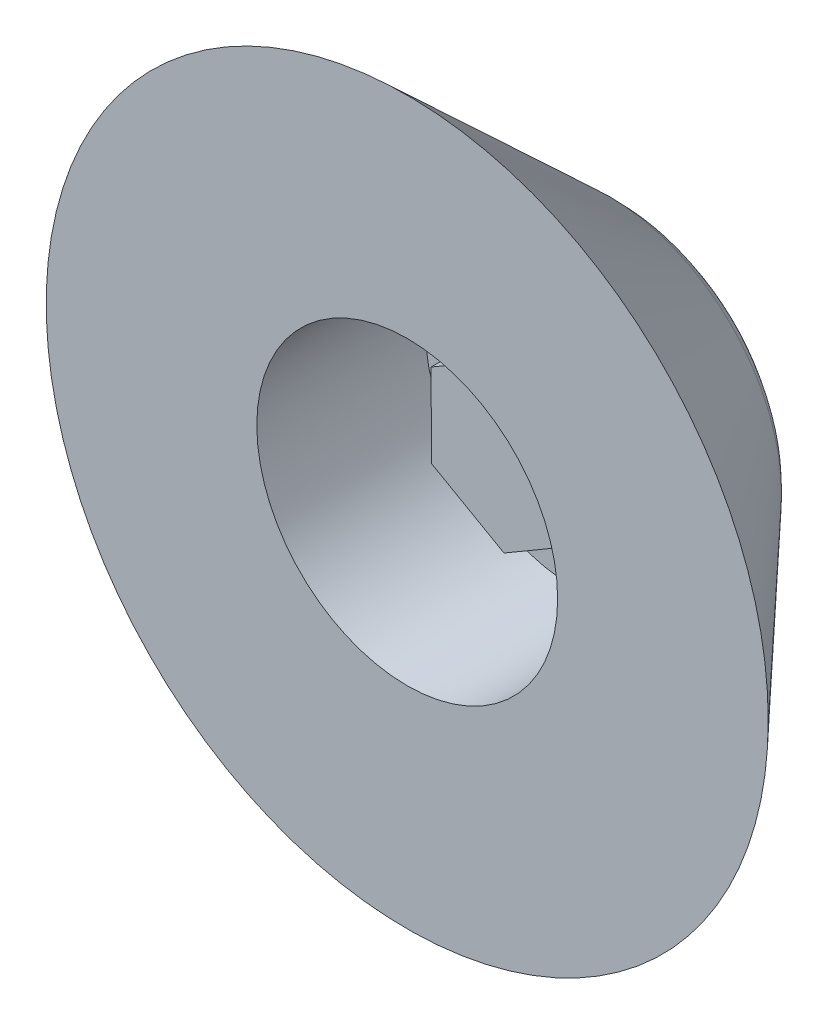
ISO-10303-21;
HEADER;
FILE_DESCRIPTION(('STEP AP214'),'2;1');
FILE_NAME('part.step','',(''),(''),'','','');
FILE_SCHEMA(('AUTOMOTIVE_DESIGN { 1 0 10303 214 1 1 1 1 }'));
ENDSEC;
DATA;
#1=APPLICATION_CONTEXT('core data for automotive mechanical design processes');
#2=APPLICATION_PROTOCOL_DEFINITION('international standard','automotive_design',2000,#1);
#3=PRODUCT_CONTEXT('',#1,'mechanical');
#4=PRODUCT('Part','Part','',(#3));
#5=PRODUCT_RELATED_PRODUCT_CATEGORY('part','',(#4));
#6=PRODUCT_DEFINITION_FORMATION('','',#4);
#7=PRODUCT_DEFINITION_CONTEXT('part definition',#1,'design');
#8=PRODUCT_DEFINITION('design','',#6,#7);
#9=PRODUCT_DEFINITION_SHAPE('','',#8);
#10=(LENGTH_UNIT() NAMED_UNIT(*) SI_UNIT(.MILLI.,.METRE.));
#11=(NAMED_UNIT(*) PLANE_ANGLE_UNIT() SI_UNIT($,.RADIAN.));
#12=(NAMED_UNIT(*) SI_UNIT($,.STERADIAN.) SOLID_ANGLE_UNIT());
#13=UNCERTAINTY_MEASURE_WITH_UNIT(LENGTH_MEASURE(1.E-05),#10,'distance_accuracy_value','');
#14=(GEOMETRIC_REPRESENTATION_CONTEXT(3) GLOBAL_UNCERTAINTY_ASSIGNED_CONTEXT((#13)) GLOBAL_UNIT_ASSIGNED_CONTEXT((#10,
#11,#12)) REPRESENTATION_CONTEXT('',''));
#15=CARTESIAN_POINT('',(0.,0.,0.));
#16=DIRECTION('',(0.,0.,1.));
#17=DIRECTION('',(1.,0.,0.));
#18=AXIS2_PLACEMENT_3D('',#15,#16,#17);
#19=CARTESIAN_POINT('',(3.0104357273615,-1.71384851472511,-7.));
#20=DIRECTION('',(0.999981657172069,0.0060568407112784,0.));
#21=DIRECTION('',(-0.00605684071127841,0.99998165717207,0.));
#22=AXIS2_PLACEMENT_3D('',#19,#20,#21);
#23=PLANE('',#22);
#24=DIRECTION('',(0.,0.,1.));
#25=VECTOR('',#24,1.);
#26=CARTESIAN_POINT('',(2.98945421567092,1.75018955899278,-7.));
#27=LINE('',#26,#25);
#28=CARTESIAN_POINT('',(2.98945421567092,1.75018955899278,-7.));
#29=VERTEX_POINT('',#28);
#30=CARTESIAN_POINT('',(2.98945421567092,1.75018955899278,-4.));
#31=VERTEX_POINT('',#30);
#32=EDGE_CURVE('E114',#29,#31,#27,.T.);
#33=ORIENTED_EDGE('',*,*,#32,.T.);
#34=DIRECTION('',(-0.00605684071128592,0.999981657172069,0.));
#35=VECTOR('',#34,1.);
#36=CARTESIAN_POINT('',(3.01043572736151,-1.71384851472509,-4.));
#37=LINE('',#36,#35);
#38=CARTESIAN_POINT('',(3.01043572736151,-1.71384851472509,-4.));
#39=VERTEX_POINT('',#38);
#40=EDGE_CURVE('E55',#39,#31,#37,.T.);
#41=ORIENTED_EDGE('',*,*,#40,.F.);
#42=DIRECTION('',(0.,0.,1.));
#43=VECTOR('',#42,1.);
#44=CARTESIAN_POINT('',(3.0104357273615,-1.71384851472511,-7.));
#45=LINE('',#44,#43);
#46=CARTESIAN_POINT('',(3.0104357273615,-1.71384851472511,-7.));
#47=VERTEX_POINT('',#46);
#48=EDGE_CURVE('E133',#47,#39,#45,.T.);
#49=ORIENTED_EDGE('',*,*,#48,.F.);
#50=DIRECTION('',(-0.0060568407112784,0.999981657172069,0.));
#51=VECTOR('',#50,1.);
#52=CARTESIAN_POINT('',(3.0104357273615,-1.71384851472511,-7.));
#53=LINE('',#52,#51);
#54=EDGE_CURVE('E229',#47,#29,#53,.T.);
#55=ORIENTED_EDGE('',*,*,#54,.T.);
#56=EDGE_LOOP('',(#33,#41,#49,#55));
#57=FACE_BOUND('',#56,.T.);
#58=ADVANCED_FACE('F39',(#57),#23,.T.);
#59=CARTESIAN_POINT('',(0.0209815116905734,-3.46403807371789,-7.));
#60=DIRECTION('',(0.505236206508678,-0.862981098073834,0.));
#61=DIRECTION('',(0.862981098073834,0.505236206508678,0.));
#62=AXIS2_PLACEMENT_3D('',#59,#60,#61);
#63=PLANE('',#62);
#64=ORIENTED_EDGE('',*,*,#48,.T.);
#65=DIRECTION('',(0.86298109807383,0.505236206508684,0.));
#66=VECTOR('',#65,1.);
#67=CARTESIAN_POINT('',(0.0209815116905981,-3.46403807371789,-4.));
#68=LINE('',#67,#66);
#69=CARTESIAN_POINT('',(0.0209815116905981,-3.46403807371789,-4.));
#70=VERTEX_POINT('',#69);
#71=EDGE_CURVE('E235',#70,#39,#68,.T.);
#72=ORIENTED_EDGE('',*,*,#71,.F.);
#73=DIRECTION('',(0.,0.,1.));
#74=VECTOR('',#73,1.);
#75=CARTESIAN_POINT('',(0.0209815116905734,-3.46403807371789,-7.));
#76=LINE('',#75,#74);
#77=CARTESIAN_POINT('',(0.0209815116905734,-3.46403807371789,-7.));
#78=VERTEX_POINT('',#77);
#79=EDGE_CURVE('E202',#78,#70,#76,.T.);
#80=ORIENTED_EDGE('',*,*,#79,.F.);
#81=DIRECTION('',(0.862981098073834,0.505236206508678,0.));
#82=VECTOR('',#81,1.);
#83=CARTESIAN_POINT('',(0.0209815116905734,-3.46403807371789,-7.));
#84=LINE('',#83,#82);
#85=EDGE_CURVE('E120',#78,#47,#84,.T.);
#86=ORIENTED_EDGE('',*,*,#85,.T.);
#87=EDGE_LOOP('',(#64,#72,#80,#86));
#88=FACE_BOUND('',#87,.T.);
#89=ADVANCED_FACE('F152',(#88),#63,.T.);
#90=CARTESIAN_POINT('',(-2.98945421567092,-1.75018955899278,-7.));
#91=DIRECTION('',(-0.494745450663392,-0.869037938785113,0.));
#92=DIRECTION('',(0.869037938785113,-0.494745450663392,0.));
#93=AXIS2_PLACEMENT_3D('',#90,#91,#92);
#94=PLANE('',#93);
#95=ORIENTED_EDGE('',*,*,#79,.T.);
#96=DIRECTION('',(0.869037938785116,-0.494745450663385,0.));
#97=VECTOR('',#96,1.);
#98=CARTESIAN_POINT('',(-2.98945421567091,-1.7501895589928,-4.));
#99=LINE('',#98,#97);
#100=CARTESIAN_POINT('',(-2.98945421567091,-1.7501895589928,-4.));
#101=VERTEX_POINT('',#100);
#102=EDGE_CURVE('E203',#101,#70,#99,.T.);
#103=ORIENTED_EDGE('',*,*,#102,.F.);
#104=DIRECTION('',(0.,0.,1.));
#105=VECTOR('',#104,1.);
#106=CARTESIAN_POINT('',(-2.98945421567092,-1.75018955899278,-7.));
#107=LINE('',#106,#105);
#108=CARTESIAN_POINT('',(-2.98945421567092,-1.75018955899278,-7.));
#109=VERTEX_POINT('',#108);
#110=EDGE_CURVE('E118',#109,#101,#107,.T.);
#111=ORIENTED_EDGE('',*,*,#110,.F.);
#112=DIRECTION('',(0.869037938785113,-0.494745450663392,0.));
#113=VECTOR('',#112,1.);
#114=CARTESIAN_POINT('',(-2.98945421567092,-1.75018955899278,-7.));
#115=LINE('',#114,#113);
#116=EDGE_CURVE('E206',#109,#78,#115,.T.);
#117=ORIENTED_EDGE('',*,*,#116,.T.);
#118=EDGE_LOOP('',(#95,#103,#111,#117));
#119=FACE_BOUND('',#118,.T.);
#120=ADVANCED_FACE('F158',(#119),#94,.T.);
#121=CARTESIAN_POINT('',(-3.01043572736149,1.71384851472511,-7.));
#122=DIRECTION('',(-0.99998165717207,-0.00605684071127803,0.));
#123=DIRECTION('',(0.00605684071127803,-0.99998165717207,0.));
#124=AXIS2_PLACEMENT_3D('',#121,#122,#123);
#125=PLANE('',#124);
#126=ORIENTED_EDGE('',*,*,#110,.T.);
#127=DIRECTION('',(0.00605684071128605,-0.999981657172069,0.));
#128=VECTOR('',#127,1.);
#129=CARTESIAN_POINT('',(-3.01043572736151,1.71384851472509,-4.));
#130=LINE('',#129,#128);
#131=CARTESIAN_POINT('',(-3.01043572736151,1.71384851472509,-4.));
#132=VERTEX_POINT('',#131);
#133=EDGE_CURVE('E109',#132,#101,#130,.T.);
#134=ORIENTED_EDGE('',*,*,#133,.F.);
#135=DIRECTION('',(0.,0.,1.));
#136=VECTOR('',#135,1.);
#137=CARTESIAN_POINT('',(-3.01043572736149,1.71384851472511,-7.));
#138=LINE('',#137,#136);
#139=CARTESIAN_POINT('',(-3.01043572736149,1.71384851472511,-7.));
#140=VERTEX_POINT('',#139);
#141=EDGE_CURVE('E107',#140,#132,#138,.T.);
#142=ORIENTED_EDGE('',*,*,#141,.F.);
#143=DIRECTION('',(0.00605684071127803,-0.999981657172069,0.));
#144=VECTOR('',#143,1.);
#145=CARTESIAN_POINT('',(-3.01043572736149,1.71384851472511,-7.));
#146=LINE('',#145,#144);
#147=EDGE_CURVE('E221',#140,#109,#146,.T.);
#148=ORIENTED_EDGE('',*,*,#147,.T.);
#149=EDGE_LOOP('',(#126,#134,#142,#148));
#150=FACE_BOUND('',#149,.T.);
#151=ADVANCED_FACE('F188',(#150),#125,.T.);
#152=CARTESIAN_POINT('',(-0.0209815116905708,3.4640380737179,-7.));
#153=DIRECTION('',(-0.505236206508678,0.862981098073834,0.));
#154=DIRECTION('',(-0.862981098073834,-0.505236206508678,0.));
#155=AXIS2_PLACEMENT_3D('',#152,#153,#154);
#156=PLANE('',#155);
#157=ORIENTED_EDGE('',*,*,#141,.T.);
#158=DIRECTION('',(-0.86298109807383,-0.505236206508684,0.));
#159=VECTOR('',#158,1.);
#160=CARTESIAN_POINT('',(-0.0209815116905981,3.46403807371789,-4.));
#161=LINE('',#160,#159);
#162=CARTESIAN_POINT('',(-0.0209815116905981,3.46403807371789,-4.));
#163=VERTEX_POINT('',#162);
#164=EDGE_CURVE('E95',#163,#132,#161,.T.);
#165=ORIENTED_EDGE('',*,*,#164,.F.);
#166=DIRECTION('',(0.,0.,1.));
#167=VECTOR('',#166,1.);
#168=CARTESIAN_POINT('',(-0.0209815116905708,3.4640380737179,-7.));
#169=LINE('',#168,#167);
#170=CARTESIAN_POINT('',(-0.0209815116905708,3.4640380737179,-7.));
#171=VERTEX_POINT('',#170);
#172=EDGE_CURVE('E105',#171,#163,#169,.T.);
#173=ORIENTED_EDGE('',*,*,#172,.F.);
#174=DIRECTION('',(-0.862981098073834,-0.505236206508678,0.));
#175=VECTOR('',#174,1.);
#176=CARTESIAN_POINT('',(-0.0209815116905708,3.4640380737179,-7.));
#177=LINE('',#176,#175);
#178=EDGE_CURVE('E63',#171,#140,#177,.T.);
#179=ORIENTED_EDGE('',*,*,#178,.T.);
#180=EDGE_LOOP('',(#157,#165,#173,#179));
#181=FACE_BOUND('',#180,.T.);
#182=ADVANCED_FACE('F104',(#181),#156,.T.);
#183=CARTESIAN_POINT('',(2.98945421567092,1.75018955899278,-7.));
#184=DIRECTION('',(0.494745450663392,0.869037938785113,0.));
#185=DIRECTION('',(-0.869037938785113,0.494745450663392,0.));
#186=AXIS2_PLACEMENT_3D('',#183,#184,#185);
#187=PLANE('',#186);
#188=ORIENTED_EDGE('',*,*,#172,.T.);
#189=DIRECTION('',(-0.869037938785116,0.494745450663385,0.));
#190=VECTOR('',#189,1.);
#191=CARTESIAN_POINT('',(2.98945421567091,1.75018955899281,-4.));
#192=LINE('',#191,#190);
#193=EDGE_CURVE('E92',#31,#163,#192,.T.);
#194=ORIENTED_EDGE('',*,*,#193,.F.);
#195=ORIENTED_EDGE('',*,*,#32,.F.);
#196=DIRECTION('',(-0.869037938785113,0.494745450663392,0.));
#197=VECTOR('',#196,1.);
#198=CARTESIAN_POINT('',(2.98945421567092,1.75018955899278,-7.));
#199=LINE('',#198,#197);
#200=EDGE_CURVE('E112',#29,#171,#199,.T.);
#201=ORIENTED_EDGE('',*,*,#200,.T.);
#202=EDGE_LOOP('',(#188,#194,#195,#201));
#203=FACE_BOUND('',#202,.T.);
#204=ADVANCED_FACE('F111',(#203),#187,.T.);
#205=CARTESIAN_POINT('',(15.,0.,0.));
#206=DIRECTION('',(0.,0.,1.));
#207=DIRECTION('',(1.,0.,0.));
#208=AXIS2_PLACEMENT_3D('',#205,#206,#207);
#209=PLANE('',#208);
#210=CARTESIAN_POINT('',(0.,0.,0.));
#211=DIRECTION('',(0.,0.,1.));
#212=DIRECTION('',(1.,0.,0.));
#213=AXIS2_PLACEMENT_3D('',#210,#211,#212);
#214=CIRCLE('',#213,6.25);
#215=CARTESIAN_POINT('',(6.25,0.,0.));
#216=VERTEX_POINT('',#215);
#217=EDGE_CURVE('E129',#216,#216,#214,.T.);
#218=ORIENTED_EDGE('',*,*,#217,.F.);
#219=EDGE_LOOP('',(#218));
#220=FACE_BOUND('',#219,.T.);
#221=CARTESIAN_POINT('',(0.,0.,0.));
#222=DIRECTION('',(0.,0.,1.));
#223=DIRECTION('',(1.,0.,0.));
#224=AXIS2_PLACEMENT_3D('',#221,#222,#223);
#225=CIRCLE('',#224,15.);
#226=CARTESIAN_POINT('',(15.,0.,0.));
#227=VERTEX_POINT('',#226);
#228=EDGE_CURVE('E128',#227,#227,#225,.T.);
#229=ORIENTED_EDGE('',*,*,#228,.T.);
#230=EDGE_LOOP('',(#229));
#231=FACE_BOUND('',#230,.T.);
#232=ADVANCED_FACE('F174',(#220,#231),#209,.T.);
#233=CARTESIAN_POINT('',(0.,0.,-10.));
#234=DIRECTION('',(0.,0.,-1.));
#235=DIRECTION('',(-1.,0.,0.));
#236=AXIS2_PLACEMENT_3D('',#233,#234,#235);
#237=PLANE('',#236);
#238=CARTESIAN_POINT('',(0.,0.,-10.));
#239=DIRECTION('',(0.,0.,-1.));
#240=DIRECTION('',(-1.,0.,0.));
#241=AXIS2_PLACEMENT_3D('',#238,#239,#240);
#242=CIRCLE('',#241,3.48774229514954);
#243=CARTESIAN_POINT('',(-3.48774229514954,0.,-10.));
#244=VERTEX_POINT('',#243);
#245=EDGE_CURVE('E11',#244,#244,#242,.T.);
#246=ORIENTED_EDGE('',*,*,#245,.T.);
#247=EDGE_LOOP('',(#246));
#248=FACE_BOUND('',#247,.T.);
#249=ADVANCED_FACE('F172',(#248),#237,.T.);
#250=CARTESIAN_POINT('',(0.,0.,0.));
#251=DIRECTION('',(0.,0.,1.));
#252=DIRECTION('',(1.,0.,0.));
#253=AXIS2_PLACEMENT_3D('',#250,#251,#252);
#254=CONICAL_SURFACE('',#253,15.,0.75132045181044);
#255=CARTESIAN_POINT('',(0.,0.,-8.41302162691979));
#256=DIRECTION('',(0.,0.,-1.));
#257=DIRECTION('',(-1.,0.,0.));
#258=AXIS2_PLACEMENT_3D('',#255,#256,#257);
#259=CIRCLE('',#258,7.14168309573427);
#260=CARTESIAN_POINT('',(-7.14168309573427,0.,-8.41302162691979));
#261=VERTEX_POINT('',#260);
#262=EDGE_CURVE('E48',#261,#261,#259,.F.);
#263=ORIENTED_EDGE('',*,*,#262,.T.);
#264=EDGE_LOOP('',(#263));
#265=FACE_BOUND('',#264,.T.);
#266=ORIENTED_EDGE('',*,*,#228,.F.);
#267=EDGE_LOOP('',(#266));
#268=FACE_BOUND('',#267,.T.);
#269=ADVANCED_FACE('F140',(#265,#268),#254,.T.);
#270=CARTESIAN_POINT('',(0.,0.,-7.));
#271=DIRECTION('',(0.,0.,1.));
#272=DIRECTION('',(1.,0.,0.));
#273=AXIS2_PLACEMENT_3D('',#270,#271,#272);
#274=CYLINDRICAL_SURFACE('',#273,6.25);
#275=CARTESIAN_POINT('',(0.,0.,-7.));
#276=DIRECTION('',(0.,0.,1.));
#277=DIRECTION('',(1.,0.,0.));
#278=AXIS2_PLACEMENT_3D('',#275,#276,#277);
#279=CIRCLE('',#278,6.25);
#280=CARTESIAN_POINT('',(6.25,0.,-7.));
#281=VERTEX_POINT('',#280);
#282=EDGE_CURVE('E124',#281,#281,#279,.T.);
#283=ORIENTED_EDGE('',*,*,#282,.F.);
#284=EDGE_LOOP('',(#283));
#285=FACE_BOUND('',#284,.T.);
#286=ORIENTED_EDGE('',*,*,#217,.T.);
#287=EDGE_LOOP('',(#286));
#288=FACE_BOUND('',#287,.T.);
#289=ADVANCED_FACE('F166',(#285,#288),#274,.F.);
#290=CARTESIAN_POINT('',(0.,0.,-7.));
#291=DIRECTION('',(0.,0.,1.));
#292=DIRECTION('',(1.,0.,0.));
#293=AXIS2_PLACEMENT_3D('',#290,#291,#292);
#294=PLANE('',#293);
#295=ORIENTED_EDGE('',*,*,#85,.F.);
#296=ORIENTED_EDGE('',*,*,#116,.F.);
#297=ORIENTED_EDGE('',*,*,#147,.F.);
#298=ORIENTED_EDGE('',*,*,#178,.F.);
#299=ORIENTED_EDGE('',*,*,#200,.F.);
#300=ORIENTED_EDGE('',*,*,#54,.F.);
#301=EDGE_LOOP('',(#295,#296,#297,#298,#299,#300));
#302=FACE_BOUND('',#301,.T.);
#303=ORIENTED_EDGE('',*,*,#282,.T.);
#304=EDGE_LOOP('',(#303));
#305=FACE_BOUND('',#304,.T.);
#306=ADVANCED_FACE('F148',(#302,#305),#294,.T.);
#307=CARTESIAN_POINT('',(0.,0.,-4.));
#308=DIRECTION('',(0.,0.,1.));
#309=DIRECTION('',(1.,0.,0.));
#310=AXIS2_PLACEMENT_3D('',#307,#308,#309);
#311=PLANE('',#310);
#312=ORIENTED_EDGE('',*,*,#193,.T.);
#313=ORIENTED_EDGE('',*,*,#164,.T.);
#314=ORIENTED_EDGE('',*,*,#133,.T.);
#315=ORIENTED_EDGE('',*,*,#102,.T.);
#316=ORIENTED_EDGE('',*,*,#71,.T.);
#317=ORIENTED_EDGE('',*,*,#40,.T.);
#318=EDGE_LOOP('',(#312,#313,#314,#315,#316,#317));
#319=FACE_BOUND('',#318,.T.);
#320=ADVANCED_FACE('F94',(#319),#311,.T.);
#321=CARTESIAN_POINT('',(0.,0.,-5.));
#322=DIRECTION('',(0.,0.,-1.));
#323=DIRECTION('',(-1.,0.,0.));
#324=AXIS2_PLACEMENT_3D('',#321,#322,#323);
#325=DEGENERATE_TOROIDAL_SURFACE('',#324,3.48774229514954,5.,.T.);
#326=ORIENTED_EDGE('',*,*,#245,.F.);
#327=EDGE_LOOP('',(#326));
#328=FACE_BOUND('',#327,.T.);
#329=ORIENTED_EDGE('',*,*,#262,.F.);
#330=EDGE_LOOP('',(#329));
#331=FACE_BOUND('',#330,.T.);
#332=ADVANCED_FACE('F41',(#328,#331),#325,.T.);
#333=CLOSED_SHELL('',(#58,#89,#120,#151,#182,#204,#232,#249,#269,#289,#306,#320,#332));
#334=MANIFOLD_SOLID_BREP('B2',#333);
#335=ADVANCED_BREP_SHAPE_REPRESENTATION('',(#18,#334),#14);
#336=SHAPE_DEFINITION_REPRESENTATION(#9,#335);
ENDSEC;
END-ISO-10303-21;
